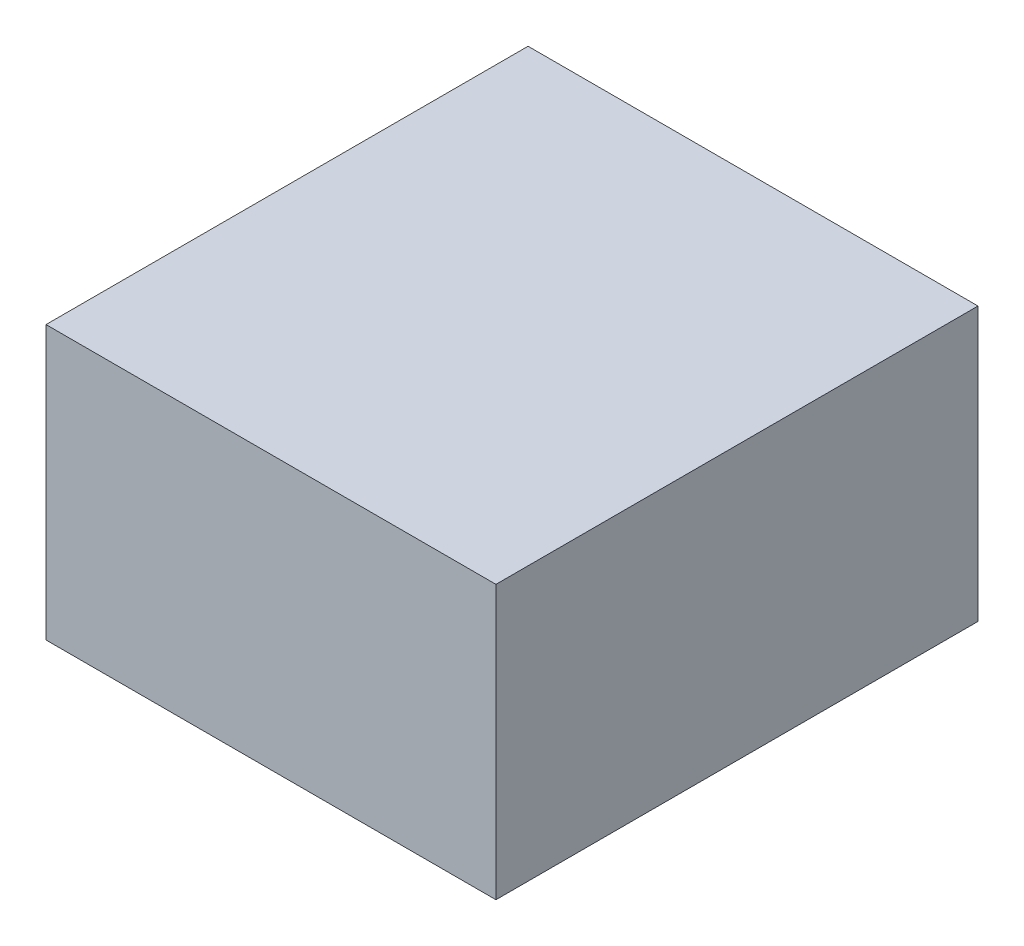
ISO-10303-21;
HEADER;
FILE_DESCRIPTION(('STEP AP214'),'2;1');
FILE_NAME('part.step','',(''),(''),'','','');
FILE_SCHEMA(('AUTOMOTIVE_DESIGN { 1 0 10303 214 1 1 1 1 }'));
ENDSEC;
DATA;
#1=APPLICATION_CONTEXT('core data for automotive mechanical design processes');
#2=APPLICATION_PROTOCOL_DEFINITION('international standard','automotive_design',2000,#1);
#3=PRODUCT_CONTEXT('',#1,'mechanical');
#4=PRODUCT('Part','Part','',(#3));
#5=PRODUCT_RELATED_PRODUCT_CATEGORY('part','',(#4));
#6=PRODUCT_DEFINITION_FORMATION('','',#4);
#7=PRODUCT_DEFINITION_CONTEXT('part definition',#1,'design');
#8=PRODUCT_DEFINITION('design','',#6,#7);
#9=PRODUCT_DEFINITION_SHAPE('','',#8);
#10=(LENGTH_UNIT() NAMED_UNIT(*) SI_UNIT(.MILLI.,.METRE.));
#11=(NAMED_UNIT(*) PLANE_ANGLE_UNIT() SI_UNIT($,.RADIAN.));
#12=(NAMED_UNIT(*) SI_UNIT($,.STERADIAN.) SOLID_ANGLE_UNIT());
#13=UNCERTAINTY_MEASURE_WITH_UNIT(LENGTH_MEASURE(1.E-05),#10,'distance_accuracy_value','');
#14=(GEOMETRIC_REPRESENTATION_CONTEXT(3) GLOBAL_UNCERTAINTY_ASSIGNED_CONTEXT((#13)) GLOBAL_UNIT_ASSIGNED_CONTEXT((#10,
#11,#12)) REPRESENTATION_CONTEXT('',''));
#15=CARTESIAN_POINT('',(0.,0.,0.));
#16=DIRECTION('',(0.,0.,1.));
#17=DIRECTION('',(1.,0.,0.));
#18=AXIS2_PLACEMENT_3D('',#15,#16,#17);
#19=CARTESIAN_POINT('',(70.,85.,-75.));
#20=DIRECTION('',(-1.,0.,0.));
#21=DIRECTION('',(0.,0.,1.));
#22=AXIS2_PLACEMENT_3D('',#19,#20,#21);
#23=PLANE('',#22);
#24=DIRECTION('',(0.,0.,-1.));
#25=VECTOR('',#24,1.);
#26=CARTESIAN_POINT('',(70.,0.,-75.));
#27=LINE('',#26,#25);
#28=CARTESIAN_POINT('',(70.,0.,75.));
#29=VERTEX_POINT('',#28);
#30=CARTESIAN_POINT('',(70.,0.,-75.));
#31=VERTEX_POINT('',#30);
#32=EDGE_CURVE('E165',#29,#31,#27,.T.);
#33=ORIENTED_EDGE('',*,*,#32,.T.);
#34=DIRECTION('',(0.,-1.,0.));
#35=VECTOR('',#34,1.);
#36=CARTESIAN_POINT('',(70.,85.,-75.));
#37=LINE('',#36,#35);
#38=CARTESIAN_POINT('',(70.,85.,-75.));
#39=VERTEX_POINT('',#38);
#40=EDGE_CURVE('E11',#39,#31,#37,.T.);
#41=ORIENTED_EDGE('',*,*,#40,.F.);
#42=DIRECTION('',(0.,0.,-1.));
#43=VECTOR('',#42,1.);
#44=CARTESIAN_POINT('',(70.,85.,-75.));
#45=LINE('',#44,#43);
#46=CARTESIAN_POINT('',(70.,85.,75.));
#47=VERTEX_POINT('',#46);
#48=EDGE_CURVE('E171',#47,#39,#45,.T.);
#49=ORIENTED_EDGE('',*,*,#48,.F.);
#50=DIRECTION('',(0.,-1.,0.));
#51=VECTOR('',#50,1.);
#52=CARTESIAN_POINT('',(70.,85.,75.));
#53=LINE('',#52,#51);
#54=EDGE_CURVE('E181',#47,#29,#53,.T.);
#55=ORIENTED_EDGE('',*,*,#54,.T.);
#56=EDGE_LOOP('',(#33,#41,#49,#55));
#57=FACE_BOUND('',#56,.T.);
#58=ADVANCED_FACE('F42',(#57),#23,.F.);
#59=CARTESIAN_POINT('',(-70.,85.,-75.));
#60=DIRECTION('',(0.,0.,1.));
#61=DIRECTION('',(1.,0.,0.));
#62=AXIS2_PLACEMENT_3D('',#59,#60,#61);
#63=PLANE('',#62);
#64=DIRECTION('',(-1.,0.,0.));
#65=VECTOR('',#64,1.);
#66=CARTESIAN_POINT('',(-70.,0.,-75.));
#67=LINE('',#66,#65);
#68=CARTESIAN_POINT('',(-70.,0.,-75.));
#69=VERTEX_POINT('',#68);
#70=EDGE_CURVE('E185',#31,#69,#67,.T.);
#71=ORIENTED_EDGE('',*,*,#70,.T.);
#72=DIRECTION('',(0.,-1.,0.));
#73=VECTOR('',#72,1.);
#74=CARTESIAN_POINT('',(-70.,85.,-75.));
#75=LINE('',#74,#73);
#76=CARTESIAN_POINT('',(-70.,85.,-75.));
#77=VERTEX_POINT('',#76);
#78=EDGE_CURVE('E50',#77,#69,#75,.T.);
#79=ORIENTED_EDGE('',*,*,#78,.F.);
#80=DIRECTION('',(-1.,0.,0.));
#81=VECTOR('',#80,1.);
#82=CARTESIAN_POINT('',(-70.,85.,-75.));
#83=LINE('',#82,#81);
#84=EDGE_CURVE('E94',#39,#77,#83,.T.);
#85=ORIENTED_EDGE('',*,*,#84,.F.);
#86=ORIENTED_EDGE('',*,*,#40,.T.);
#87=EDGE_LOOP('',(#71,#79,#85,#86));
#88=FACE_BOUND('',#87,.T.);
#89=ADVANCED_FACE('F220',(#88),#63,.F.);
#90=CARTESIAN_POINT('',(-70.,85.,-75.));
#91=DIRECTION('',(1.,0.,0.));
#92=DIRECTION('',(0.,0.,-1.));
#93=AXIS2_PLACEMENT_3D('',#90,#91,#92);
#94=PLANE('',#93);
#95=CARTESIAN_POINT('',(-70.,79.,69.));
#96=DIRECTION('',(-1.,0.,0.));
#97=DIRECTION('',(0.,0.,1.));
#98=AXIS2_PLACEMENT_3D('',#95,#96,#97);
#99=CIRCLE('',#98,1.75250000000001);
#100=CARTESIAN_POINT('',(-70.,79.,70.7525));
#101=VERTEX_POINT('',#100);
#102=EDGE_CURVE('E430',#101,#101,#99,.T.);
#103=ORIENTED_EDGE('',*,*,#102,.F.);
#104=EDGE_LOOP('',(#103));
#105=FACE_BOUND('',#104,.T.);
#106=CARTESIAN_POINT('',(-70.,6.,45.));
#107=DIRECTION('',(-1.,0.,0.));
#108=DIRECTION('',(0.,0.,1.));
#109=AXIS2_PLACEMENT_3D('',#106,#107,#108);
#110=CIRCLE('',#109,1.7525);
#111=CARTESIAN_POINT('',(-70.,6.,46.7525));
#112=VERTEX_POINT('',#111);
#113=EDGE_CURVE('E429',#112,#112,#110,.T.);
#114=ORIENTED_EDGE('',*,*,#113,.F.);
#115=EDGE_LOOP('',(#114));
#116=FACE_BOUND('',#115,.T.);
#117=CARTESIAN_POINT('',(-70.,16.,-69.));
#118=DIRECTION('',(-1.,0.,0.));
#119=DIRECTION('',(0.,0.,1.));
#120=AXIS2_PLACEMENT_3D('',#117,#118,#119);
#121=CIRCLE('',#120,1.75250000000001);
#122=CARTESIAN_POINT('',(-70.,16.,-67.2475));
#123=VERTEX_POINT('',#122);
#124=EDGE_CURVE('E450',#123,#123,#121,.T.);
#125=ORIENTED_EDGE('',*,*,#124,.F.);
#126=EDGE_LOOP('',(#125));
#127=FACE_BOUND('',#126,.T.);
#128=CARTESIAN_POINT('',(-70.,80.,-69.));
#129=DIRECTION('',(-1.,0.,0.));
#130=DIRECTION('',(0.,0.,1.));
#131=AXIS2_PLACEMENT_3D('',#128,#129,#130);
#132=CIRCLE('',#131,1.75250000000001);
#133=CARTESIAN_POINT('',(-70.,80.,-67.2475));
#134=VERTEX_POINT('',#133);
#135=EDGE_CURVE('E146',#134,#134,#132,.T.);
#136=ORIENTED_EDGE('',*,*,#135,.F.);
#137=EDGE_LOOP('',(#136));
#138=FACE_BOUND('',#137,.T.);
#139=DIRECTION('',(0.,0.,-1.));
#140=VECTOR('',#139,1.);
#141=CARTESIAN_POINT('',(-70.,55.6349462365596,23.5017839687195));
#142=LINE('',#141,#140);
#143=CARTESIAN_POINT('',(-70.,55.6349462365596,50.4229960899316));
#144=VERTEX_POINT('',#143);
#145=CARTESIAN_POINT('',(-70.,55.6349462365596,23.5017839687195));
#146=VERTEX_POINT('',#145);
#147=EDGE_CURVE('E155',#144,#146,#142,.T.);
#148=ORIENTED_EDGE('',*,*,#147,.F.);
#149=DIRECTION('',(0.,1.,0.));
#150=VECTOR('',#149,1.);
#151=CARTESIAN_POINT('',(-70.,55.6349462365596,50.4229960899316));
#152=LINE('',#151,#150);
#153=CARTESIAN_POINT('',(-70.,30.0163734115352,50.4229960899316));
#154=VERTEX_POINT('',#153);
#155=EDGE_CURVE('E57',#154,#144,#152,.T.);
#156=ORIENTED_EDGE('',*,*,#155,.F.);
#157=DIRECTION('',(0.,0.,1.));
#158=VECTOR('',#157,1.);
#159=CARTESIAN_POINT('',(-70.,30.0163734115352,23.5017839687195));
#160=LINE('',#159,#158);
#161=CARTESIAN_POINT('',(-70.,30.0163734115352,23.5017839687195));
#162=VERTEX_POINT('',#161);
#163=EDGE_CURVE('E139',#162,#154,#160,.T.);
#164=ORIENTED_EDGE('',*,*,#163,.F.);
#165=DIRECTION('',(0.,-1.,0.));
#166=VECTOR('',#165,1.);
#167=CARTESIAN_POINT('',(-70.,55.6349462365596,23.5017839687195));
#168=LINE('',#167,#166);
#169=EDGE_CURVE('E143',#146,#162,#168,.T.);
#170=ORIENTED_EDGE('',*,*,#169,.F.);
#171=EDGE_LOOP('',(#148,#156,#164,#170));
#172=FACE_BOUND('',#171,.T.);
#173=DIRECTION('',(0.,0.,1.));
#174=VECTOR('',#173,1.);
#175=CARTESIAN_POINT('',(-70.,0.,-75.));
#176=LINE('',#175,#174);
#177=CARTESIAN_POINT('',(-70.,0.,75.));
#178=VERTEX_POINT('',#177);
#179=EDGE_CURVE('E188',#69,#178,#176,.T.);
#180=ORIENTED_EDGE('',*,*,#179,.T.);
#181=DIRECTION('',(0.,-1.,0.));
#182=VECTOR('',#181,1.);
#183=CARTESIAN_POINT('',(-70.,85.,75.));
#184=LINE('',#183,#182);
#185=CARTESIAN_POINT('',(-70.,85.,75.));
#186=VERTEX_POINT('',#185);
#187=EDGE_CURVE('E195',#186,#178,#184,.T.);
#188=ORIENTED_EDGE('',*,*,#187,.F.);
#189=DIRECTION('',(0.,0.,1.));
#190=VECTOR('',#189,1.);
#191=CARTESIAN_POINT('',(-70.,85.,-75.));
#192=LINE('',#191,#190);
#193=EDGE_CURVE('E176',#77,#186,#192,.T.);
#194=ORIENTED_EDGE('',*,*,#193,.F.);
#195=ORIENTED_EDGE('',*,*,#78,.T.);
#196=EDGE_LOOP('',(#180,#188,#194,#195));
#197=FACE_BOUND('',#196,.T.);
#198=ADVANCED_FACE('F202',(#105,#116,#127,#138,#172,#197),#94,.F.);
#199=CARTESIAN_POINT('',(-70.,85.,75.));
#200=DIRECTION('',(0.,0.,-1.));
#201=DIRECTION('',(-1.,0.,0.));
#202=AXIS2_PLACEMENT_3D('',#199,#200,#201);
#203=PLANE('',#202);
#204=DIRECTION('',(1.,0.,0.));
#205=VECTOR('',#204,1.);
#206=CARTESIAN_POINT('',(-70.,0.,75.));
#207=LINE('',#206,#205);
#208=EDGE_CURVE('E87',#178,#29,#207,.T.);
#209=ORIENTED_EDGE('',*,*,#208,.T.);
#210=ORIENTED_EDGE('',*,*,#54,.F.);
#211=DIRECTION('',(1.,0.,0.));
#212=VECTOR('',#211,1.);
#213=CARTESIAN_POINT('',(-70.,85.,75.));
#214=LINE('',#213,#212);
#215=EDGE_CURVE('E66',#186,#47,#214,.T.);
#216=ORIENTED_EDGE('',*,*,#215,.F.);
#217=ORIENTED_EDGE('',*,*,#187,.T.);
#218=EDGE_LOOP('',(#209,#210,#216,#217));
#219=FACE_BOUND('',#218,.T.);
#220=ADVANCED_FACE('F210',(#219),#203,.F.);
#221=CARTESIAN_POINT('',(0.,85.,0.));
#222=DIRECTION('',(0.,1.,0.));
#223=DIRECTION('',(0.,0.,1.));
#224=AXIS2_PLACEMENT_3D('',#221,#222,#223);
#225=PLANE('',#224);
#226=ORIENTED_EDGE('',*,*,#48,.T.);
#227=ORIENTED_EDGE('',*,*,#84,.T.);
#228=ORIENTED_EDGE('',*,*,#193,.T.);
#229=ORIENTED_EDGE('',*,*,#215,.T.);
#230=EDGE_LOOP('',(#226,#227,#228,#229));
#231=FACE_BOUND('',#230,.T.);
#232=ADVANCED_FACE('F212',(#231),#225,.T.);
#233=CARTESIAN_POINT('',(0.,0.,0.));
#234=DIRECTION('',(0.,1.,0.));
#235=DIRECTION('',(0.,0.,1.));
#236=AXIS2_PLACEMENT_3D('',#233,#234,#235);
#237=PLANE('',#236);
#238=ORIENTED_EDGE('',*,*,#32,.F.);
#239=ORIENTED_EDGE('',*,*,#208,.F.);
#240=ORIENTED_EDGE('',*,*,#179,.F.);
#241=ORIENTED_EDGE('',*,*,#70,.F.);
#242=EDGE_LOOP('',(#238,#239,#240,#241));
#243=FACE_BOUND('',#242,.T.);
#244=ADVANCED_FACE('F206',(#243),#237,.F.);
#245=CARTESIAN_POINT('',(-50.,55.6349462365596,50.4229960899316));
#246=DIRECTION('',(0.,0.,1.));
#247=DIRECTION('',(1.,0.,0.));
#248=AXIS2_PLACEMENT_3D('',#245,#246,#247);
#249=PLANE('',#248);
#250=ORIENTED_EDGE('',*,*,#155,.T.);
#251=DIRECTION('',(-1.,0.,0.));
#252=VECTOR('',#251,1.);
#253=CARTESIAN_POINT('',(-50.,55.6349462365596,50.4229960899316));
#254=LINE('',#253,#252);
#255=CARTESIAN_POINT('',(-50.,55.6349462365596,50.4229960899316));
#256=VERTEX_POINT('',#255);
#257=EDGE_CURVE('E114',#256,#144,#254,.T.);
#258=ORIENTED_EDGE('',*,*,#257,.F.);
#259=DIRECTION('',(0.,1.,0.));
#260=VECTOR('',#259,1.);
#261=CARTESIAN_POINT('',(-50.,55.6349462365596,50.4229960899316));
#262=LINE('',#261,#260);
#263=CARTESIAN_POINT('',(-50.,30.0163734115352,50.4229960899316));
#264=VERTEX_POINT('',#263);
#265=EDGE_CURVE('E118',#264,#256,#262,.T.);
#266=ORIENTED_EDGE('',*,*,#265,.F.);
#267=DIRECTION('',(-1.,0.,0.));
#268=VECTOR('',#267,1.);
#269=CARTESIAN_POINT('',(-50.,30.0163734115352,50.4229960899316));
#270=LINE('',#269,#268);
#271=EDGE_CURVE('E162',#264,#154,#270,.T.);
#272=ORIENTED_EDGE('',*,*,#271,.T.);
#273=EDGE_LOOP('',(#250,#258,#266,#272));
#274=FACE_BOUND('',#273,.T.);
#275=ADVANCED_FACE('F116',(#274),#249,.F.);
#276=CARTESIAN_POINT('',(-50.,30.0163734115352,23.5017839687194));
#277=DIRECTION('',(0.,-1.,0.));
#278=DIRECTION('',(0.,0.,-1.));
#279=AXIS2_PLACEMENT_3D('',#276,#277,#278);
#280=PLANE('',#279);
#281=ORIENTED_EDGE('',*,*,#163,.T.);
#282=ORIENTED_EDGE('',*,*,#271,.F.);
#283=DIRECTION('',(0.,0.,1.));
#284=VECTOR('',#283,1.);
#285=CARTESIAN_POINT('',(-50.,30.0163734115352,23.5017839687194));
#286=LINE('',#285,#284);
#287=CARTESIAN_POINT('',(-50.,30.0163734115352,23.5017839687194));
#288=VERTEX_POINT('',#287);
#289=EDGE_CURVE('E125',#288,#264,#286,.T.);
#290=ORIENTED_EDGE('',*,*,#289,.F.);
#291=DIRECTION('',(-1.,0.,0.));
#292=VECTOR('',#291,1.);
#293=CARTESIAN_POINT('',(-50.,30.0163734115352,23.5017839687194));
#294=LINE('',#293,#292);
#295=EDGE_CURVE('E166',#288,#162,#294,.T.);
#296=ORIENTED_EDGE('',*,*,#295,.T.);
#297=EDGE_LOOP('',(#281,#282,#290,#296));
#298=FACE_BOUND('',#297,.T.);
#299=ADVANCED_FACE('F358',(#298),#280,.F.);
#300=CARTESIAN_POINT('',(-50.,55.6349462365596,23.5017839687194));
#301=DIRECTION('',(0.,0.,-1.));
#302=DIRECTION('',(-1.,0.,0.));
#303=AXIS2_PLACEMENT_3D('',#300,#301,#302);
#304=PLANE('',#303);
#305=ORIENTED_EDGE('',*,*,#169,.T.);
#306=ORIENTED_EDGE('',*,*,#295,.F.);
#307=DIRECTION('',(0.,-1.,0.));
#308=VECTOR('',#307,1.);
#309=CARTESIAN_POINT('',(-50.,55.6349462365596,23.5017839687194));
#310=LINE('',#309,#308);
#311=CARTESIAN_POINT('',(-50.,55.6349462365596,23.5017839687194));
#312=VERTEX_POINT('',#311);
#313=EDGE_CURVE('E134',#312,#288,#310,.T.);
#314=ORIENTED_EDGE('',*,*,#313,.F.);
#315=DIRECTION('',(-1.,0.,0.));
#316=VECTOR('',#315,1.);
#317=CARTESIAN_POINT('',(-50.,55.6349462365596,23.5017839687194));
#318=LINE('',#317,#316);
#319=EDGE_CURVE('E124',#312,#146,#318,.T.);
#320=ORIENTED_EDGE('',*,*,#319,.T.);
#321=EDGE_LOOP('',(#305,#306,#314,#320));
#322=FACE_BOUND('',#321,.T.);
#323=ADVANCED_FACE('F350',(#322),#304,.F.);
#324=CARTESIAN_POINT('',(-50.,55.6349462365596,23.5017839687194));
#325=DIRECTION('',(0.,1.,0.));
#326=DIRECTION('',(0.,0.,1.));
#327=AXIS2_PLACEMENT_3D('',#324,#325,#326);
#328=PLANE('',#327);
#329=ORIENTED_EDGE('',*,*,#147,.T.);
#330=ORIENTED_EDGE('',*,*,#319,.F.);
#331=DIRECTION('',(0.,0.,-1.));
#332=VECTOR('',#331,1.);
#333=CARTESIAN_POINT('',(-50.,55.6349462365596,23.5017839687194));
#334=LINE('',#333,#332);
#335=EDGE_CURVE('E128',#256,#312,#334,.T.);
#336=ORIENTED_EDGE('',*,*,#335,.F.);
#337=ORIENTED_EDGE('',*,*,#257,.T.);
#338=EDGE_LOOP('',(#329,#330,#336,#337));
#339=FACE_BOUND('',#338,.T.);
#340=ADVANCED_FACE('F129',(#339),#328,.F.);
#341=CARTESIAN_POINT('',(-50.,0.,0.));
#342=DIRECTION('',(-1.,0.,0.));
#343=DIRECTION('',(0.,0.,1.));
#344=AXIS2_PLACEMENT_3D('',#341,#342,#343);
#345=PLANE('',#344);
#346=ORIENTED_EDGE('',*,*,#265,.T.);
#347=ORIENTED_EDGE('',*,*,#335,.T.);
#348=ORIENTED_EDGE('',*,*,#313,.T.);
#349=ORIENTED_EDGE('',*,*,#289,.T.);
#350=EDGE_LOOP('',(#346,#347,#348,#349));
#351=FACE_BOUND('',#350,.T.);
#352=ADVANCED_FACE('F136',(#351),#345,.T.);
#353=CARTESIAN_POINT('',(-60.,80.,-69.));
#354=DIRECTION('',(-1.,0.,0.));
#355=DIRECTION('',(0.,0.,1.));
#356=AXIS2_PLACEMENT_3D('',#353,#354,#355);
#357=CYLINDRICAL_SURFACE('',#356,1.75250000000001);
#358=CARTESIAN_POINT('',(-60.,80.,-69.));
#359=DIRECTION('',(-1.,0.,0.));
#360=DIRECTION('',(0.,0.,1.));
#361=AXIS2_PLACEMENT_3D('',#358,#359,#360);
#362=CIRCLE('',#361,1.75250000000001);
#363=CARTESIAN_POINT('',(-60.,80.,-67.2475));
#364=VERTEX_POINT('',#363);
#365=EDGE_CURVE('E156',#364,#364,#362,.T.);
#366=ORIENTED_EDGE('',*,*,#365,.F.);
#367=EDGE_LOOP('',(#366));
#368=FACE_BOUND('',#367,.T.);
#369=ORIENTED_EDGE('',*,*,#135,.T.);
#370=EDGE_LOOP('',(#369));
#371=FACE_BOUND('',#370,.T.);
#372=ADVANCED_FACE('F245',(#368,#371),#357,.F.);
#373=CARTESIAN_POINT('',(-60.,0.,0.));
#374=DIRECTION('',(-1.,0.,0.));
#375=DIRECTION('',(0.,0.,1.));
#376=AXIS2_PLACEMENT_3D('',#373,#374,#375);
#377=PLANE('',#376);
#378=ORIENTED_EDGE('',*,*,#365,.T.);
#379=EDGE_LOOP('',(#378));
#380=FACE_BOUND('',#379,.T.);
#381=ADVANCED_FACE('F250',(#380),#377,.T.);
#382=CARTESIAN_POINT('',(-60.,16.,-69.));
#383=DIRECTION('',(-1.,0.,0.));
#384=DIRECTION('',(0.,0.,1.));
#385=AXIS2_PLACEMENT_3D('',#382,#383,#384);
#386=CYLINDRICAL_SURFACE('',#385,1.75250000000001);
#387=CARTESIAN_POINT('',(-60.,16.,-69.));
#388=DIRECTION('',(-1.,0.,0.));
#389=DIRECTION('',(0.,0.,1.));
#390=AXIS2_PLACEMENT_3D('',#387,#388,#389);
#391=CIRCLE('',#390,1.75250000000001);
#392=CARTESIAN_POINT('',(-60.,16.,-67.2475));
#393=VERTEX_POINT('',#392);
#394=EDGE_CURVE('E445',#393,#393,#391,.T.);
#395=ORIENTED_EDGE('',*,*,#394,.F.);
#396=EDGE_LOOP('',(#395));
#397=FACE_BOUND('',#396,.T.);
#398=ORIENTED_EDGE('',*,*,#124,.T.);
#399=EDGE_LOOP('',(#398));
#400=FACE_BOUND('',#399,.T.);
#401=ADVANCED_FACE('F261',(#397,#400),#386,.F.);
#402=CARTESIAN_POINT('',(-60.,0.,0.));
#403=DIRECTION('',(-1.,0.,0.));
#404=DIRECTION('',(0.,0.,1.));
#405=AXIS2_PLACEMENT_3D('',#402,#403,#404);
#406=PLANE('',#405);
#407=ORIENTED_EDGE('',*,*,#394,.T.);
#408=EDGE_LOOP('',(#407));
#409=FACE_BOUND('',#408,.T.);
#410=ADVANCED_FACE('F272',(#409),#406,.T.);
#411=CARTESIAN_POINT('',(-60.,6.,45.));
#412=DIRECTION('',(-1.,0.,0.));
#413=DIRECTION('',(0.,0.,1.));
#414=AXIS2_PLACEMENT_3D('',#411,#412,#413);
#415=CYLINDRICAL_SURFACE('',#414,1.7525);
#416=CARTESIAN_POINT('',(-60.,6.,45.));
#417=DIRECTION('',(-1.,0.,0.));
#418=DIRECTION('',(0.,0.,1.));
#419=AXIS2_PLACEMENT_3D('',#416,#417,#418);
#420=CIRCLE('',#419,1.7525);
#421=CARTESIAN_POINT('',(-60.,6.,46.7525));
#422=VERTEX_POINT('',#421);
#423=EDGE_CURVE('E435',#422,#422,#420,.T.);
#424=ORIENTED_EDGE('',*,*,#423,.F.);
#425=EDGE_LOOP('',(#424));
#426=FACE_BOUND('',#425,.T.);
#427=ORIENTED_EDGE('',*,*,#113,.T.);
#428=EDGE_LOOP('',(#427));
#429=FACE_BOUND('',#428,.T.);
#430=ADVANCED_FACE('F283',(#426,#429),#415,.F.);
#431=CARTESIAN_POINT('',(-60.,0.,0.));
#432=DIRECTION('',(-1.,0.,0.));
#433=DIRECTION('',(0.,0.,1.));
#434=AXIS2_PLACEMENT_3D('',#431,#432,#433);
#435=PLANE('',#434);
#436=ORIENTED_EDGE('',*,*,#423,.T.);
#437=EDGE_LOOP('',(#436));
#438=FACE_BOUND('',#437,.T.);
#439=ADVANCED_FACE('F294',(#438),#435,.T.);
#440=CARTESIAN_POINT('',(-60.,79.,69.));
#441=DIRECTION('',(-1.,0.,0.));
#442=DIRECTION('',(0.,0.,1.));
#443=AXIS2_PLACEMENT_3D('',#440,#441,#442);
#444=CYLINDRICAL_SURFACE('',#443,1.75250000000001);
#445=CARTESIAN_POINT('',(-60.,79.,69.));
#446=DIRECTION('',(-1.,0.,0.));
#447=DIRECTION('',(0.,0.,1.));
#448=AXIS2_PLACEMENT_3D('',#445,#446,#447);
#449=CIRCLE('',#448,1.75250000000001);
#450=CARTESIAN_POINT('',(-60.,79.,70.7525));
#451=VERTEX_POINT('',#450);
#452=EDGE_CURVE('E427',#451,#451,#449,.T.);
#453=ORIENTED_EDGE('',*,*,#452,.F.);
#454=EDGE_LOOP('',(#453));
#455=FACE_BOUND('',#454,.T.);
#456=ORIENTED_EDGE('',*,*,#102,.T.);
#457=EDGE_LOOP('',(#456));
#458=FACE_BOUND('',#457,.T.);
#459=ADVANCED_FACE('F305',(#455,#458),#444,.F.);
#460=CARTESIAN_POINT('',(-60.,0.,0.));
#461=DIRECTION('',(-1.,0.,0.));
#462=DIRECTION('',(0.,0.,1.));
#463=AXIS2_PLACEMENT_3D('',#460,#461,#462);
#464=PLANE('',#463);
#465=ORIENTED_EDGE('',*,*,#452,.T.);
#466=EDGE_LOOP('',(#465));
#467=FACE_BOUND('',#466,.T.);
#468=ADVANCED_FACE('F316',(#467),#464,.T.);
#469=CLOSED_SHELL('',(#58,#89,#198,#220,#232,#244,#275,#299,#323,#340,#352,#372,#381,#401,#410,
#430,#439,#459,#468));
#470=MANIFOLD_SOLID_BREP('B2',#469);
#471=ADVANCED_BREP_SHAPE_REPRESENTATION('',(#18,#470),#14);
#472=SHAPE_DEFINITION_REPRESENTATION(#9,#471);
ENDSEC;
END-ISO-10303-21;
